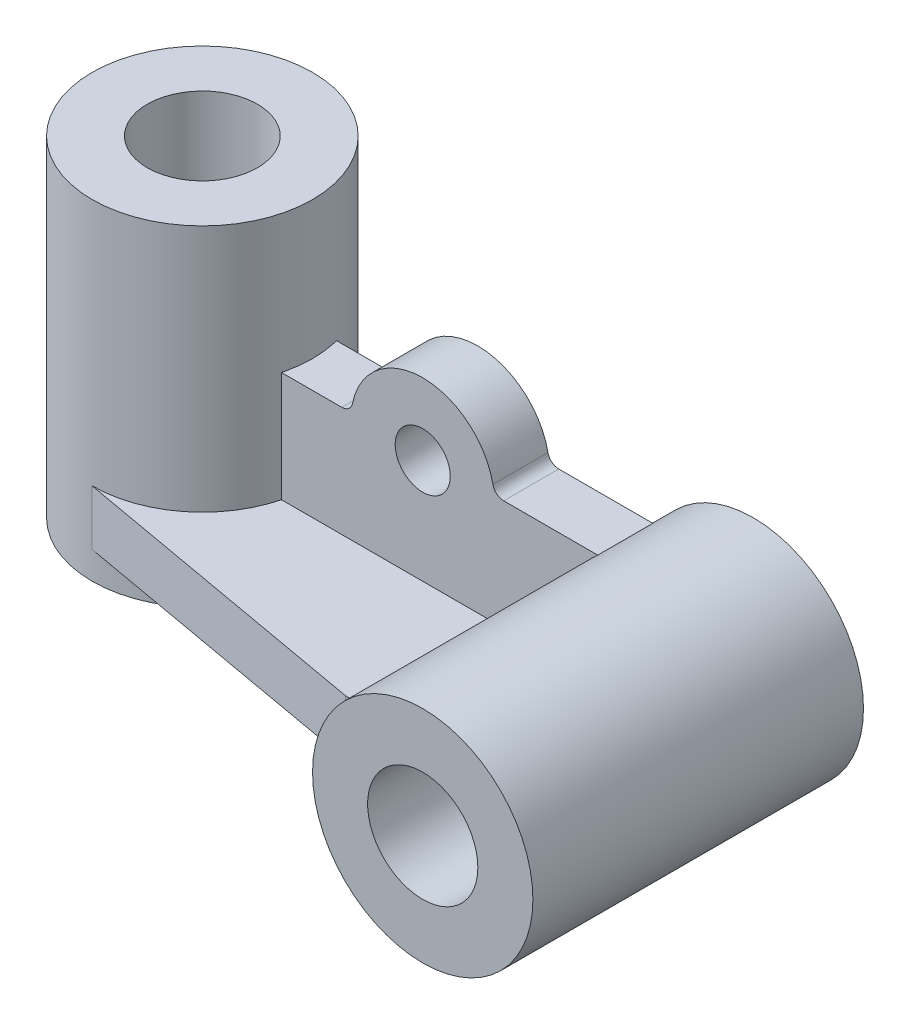
ISO-10303-21;
HEADER;
FILE_DESCRIPTION(('STEP AP214'),'2;1');
FILE_NAME('part.step','',(''),(''),'','','');
FILE_SCHEMA(('AUTOMOTIVE_DESIGN { 1 0 10303 214 1 1 1 1 }'));
ENDSEC;
DATA;
#1=APPLICATION_CONTEXT('core data for automotive mechanical design processes');
#2=APPLICATION_PROTOCOL_DEFINITION('international standard','automotive_design',2000,#1);
#3=PRODUCT_CONTEXT('',#1,'mechanical');
#4=PRODUCT('Part','Part','',(#3));
#5=PRODUCT_RELATED_PRODUCT_CATEGORY('part','',(#4));
#6=PRODUCT_DEFINITION_FORMATION('','',#4);
#7=PRODUCT_DEFINITION_CONTEXT('part definition',#1,'design');
#8=PRODUCT_DEFINITION('design','',#6,#7);
#9=PRODUCT_DEFINITION_SHAPE('','',#8);
#10=(LENGTH_UNIT() NAMED_UNIT(*) SI_UNIT(.MILLI.,.METRE.));
#11=(NAMED_UNIT(*) PLANE_ANGLE_UNIT() SI_UNIT($,.RADIAN.));
#12=(NAMED_UNIT(*) SI_UNIT($,.STERADIAN.) SOLID_ANGLE_UNIT());
#13=UNCERTAINTY_MEASURE_WITH_UNIT(LENGTH_MEASURE(1.E-05),#10,'distance_accuracy_value','');
#14=(GEOMETRIC_REPRESENTATION_CONTEXT(3) GLOBAL_UNCERTAINTY_ASSIGNED_CONTEXT((#13)) GLOBAL_UNIT_ASSIGNED_CONTEXT((#10,
#11,#12)) REPRESENTATION_CONTEXT('',''));
#15=CARTESIAN_POINT('',(0.,0.,0.));
#16=DIRECTION('',(0.,0.,1.));
#17=DIRECTION('',(1.,0.,0.));
#18=AXIS2_PLACEMENT_3D('',#15,#16,#17);
#19=CARTESIAN_POINT('',(77.3091008088365,-15.,30.));
#20=DIRECTION('',(-1.,0.,0.));
#21=DIRECTION('',(0.,0.,1.));
#22=AXIS2_PLACEMENT_3D('',#19,#20,#21);
#23=PLANE('',#22);
#24=DIRECTION('',(0.,0.,-1.));
#25=VECTOR('',#24,1.);
#26=CARTESIAN_POINT('',(77.3091008088365,-25.,30.));
#27=LINE('',#26,#25);
#28=CARTESIAN_POINT('',(77.3091008088365,-25.,30.));
#29=VERTEX_POINT('',#28);
#30=CARTESIAN_POINT('',(77.3091008088365,-25.,5.));
#31=VERTEX_POINT('',#30);
#32=EDGE_CURVE('E124',#29,#31,#27,.T.);
#33=ORIENTED_EDGE('',*,*,#32,.T.);
#34=DIRECTION('',(0.,-1.,0.));
#35=VECTOR('',#34,1.);
#36=CARTESIAN_POINT('',(77.3091008088365,-15.,5.));
#37=LINE('',#36,#35);
#38=CARTESIAN_POINT('',(77.3091008088365,-15.,5.));
#39=VERTEX_POINT('',#38);
#40=EDGE_CURVE('E12',#39,#31,#37,.T.);
#41=ORIENTED_EDGE('',*,*,#40,.F.);
#42=DIRECTION('',(0.,0.,-1.));
#43=VECTOR('',#42,1.);
#44=CARTESIAN_POINT('',(77.3091008088365,-15.,30.));
#45=LINE('',#44,#43);
#46=CARTESIAN_POINT('',(77.3091008088365,-15.,30.));
#47=VERTEX_POINT('',#46);
#48=EDGE_CURVE('E132',#47,#39,#45,.T.);
#49=ORIENTED_EDGE('',*,*,#48,.F.);
#50=DIRECTION('',(0.,-1.,0.));
#51=VECTOR('',#50,1.);
#52=CARTESIAN_POINT('',(77.3091008088365,-15.,30.));
#53=LINE('',#52,#51);
#54=EDGE_CURVE('E120',#47,#29,#53,.T.);
#55=ORIENTED_EDGE('',*,*,#54,.T.);
#56=EDGE_LOOP('',(#33,#41,#49,#55));
#57=FACE_BOUND('',#56,.T.);
#58=ADVANCED_FACE('F50',(#57),#23,.F.);
#59=CARTESIAN_POINT('',(19.3649167310371,-15.,5.));
#60=DIRECTION('',(0.,0.,1.));
#61=DIRECTION('',(1.,0.,0.));
#62=AXIS2_PLACEMENT_3D('',#59,#60,#61);
#63=PLANE('',#62);
#64=DIRECTION('',(-1.,0.,0.));
#65=VECTOR('',#64,1.);
#66=CARTESIAN_POINT('',(19.3649167310371,-25.,5.));
#67=LINE('',#66,#65);
#68=CARTESIAN_POINT('',(19.3649167310371,-25.,5.));
#69=VERTEX_POINT('',#68);
#70=EDGE_CURVE('E127',#31,#69,#67,.T.);
#71=ORIENTED_EDGE('',*,*,#70,.T.);
#72=DIRECTION('',(0.,-1.,0.));
#73=VECTOR('',#72,1.);
#74=CARTESIAN_POINT('',(19.3649167310371,-15.,5.));
#75=LINE('',#74,#73);
#76=CARTESIAN_POINT('',(19.3649167310371,-15.,5.));
#77=VERTEX_POINT('',#76);
#78=EDGE_CURVE('E58',#77,#69,#75,.T.);
#79=ORIENTED_EDGE('',*,*,#78,.F.);
#80=DIRECTION('',(-1.,0.,0.));
#81=VECTOR('',#80,1.);
#82=CARTESIAN_POINT('',(19.3649167310371,-15.,5.));
#83=LINE('',#82,#81);
#84=EDGE_CURVE('E100',#39,#77,#83,.T.);
#85=ORIENTED_EDGE('',*,*,#84,.F.);
#86=ORIENTED_EDGE('',*,*,#40,.T.);
#87=EDGE_LOOP('',(#71,#79,#85,#86));
#88=FACE_BOUND('',#87,.T.);
#89=ADVANCED_FACE('F151',(#88),#63,.F.);
#90=CARTESIAN_POINT('',(0.,-15.,0.));
#91=DIRECTION('',(0.,-1.,0.));
#92=DIRECTION('',(0.,0.,-1.));
#93=AXIS2_PLACEMENT_3D('',#90,#91,#92);
#94=CYLINDRICAL_SURFACE('',#93,20.);
#95=CARTESIAN_POINT('',(0.,-25.,0.));
#96=DIRECTION('',(0.,-1.,0.));
#97=DIRECTION('',(0.,0.,1.));
#98=AXIS2_PLACEMENT_3D('',#95,#96,#97);
#99=CIRCLE('',#98,20.);
#100=CARTESIAN_POINT('',(0.,-25.,20.));
#101=VERTEX_POINT('',#100);
#102=EDGE_CURVE('E115',#69,#101,#99,.T.);
#103=ORIENTED_EDGE('',*,*,#102,.T.);
#104=DIRECTION('',(0.,-1.,0.));
#105=VECTOR('',#104,1.);
#106=CARTESIAN_POINT('',(0.,-15.,20.));
#107=LINE('',#106,#105);
#108=CARTESIAN_POINT('',(0.,-15.,20.));
#109=VERTEX_POINT('',#108);
#110=EDGE_CURVE('E112',#109,#101,#107,.T.);
#111=ORIENTED_EDGE('',*,*,#110,.F.);
#112=CARTESIAN_POINT('',(0.,-15.,0.));
#113=DIRECTION('',(0.,-1.,0.));
#114=DIRECTION('',(0.,0.,1.));
#115=AXIS2_PLACEMENT_3D('',#112,#113,#114);
#116=CIRCLE('',#115,20.);
#117=EDGE_CURVE('E104',#77,#109,#116,.T.);
#118=ORIENTED_EDGE('',*,*,#117,.F.);
#119=ORIENTED_EDGE('',*,*,#78,.T.);
#120=EDGE_LOOP('',(#103,#111,#118,#119));
#121=FACE_BOUND('',#120,.T.);
#122=ADVANCED_FACE('F113',(#121),#94,.F.);
#123=CARTESIAN_POINT('',(0.,-15.,20.));
#124=DIRECTION('',(0.175790638483658,0.,-0.984427575508482));
#125=DIRECTION('',(-0.984427575508482,0.,-0.175790638483658));
#126=AXIS2_PLACEMENT_3D('',#123,#124,#125);
#127=PLANE('',#126);
#128=DIRECTION('',(0.984427575508482,0.,0.175790638483658));
#129=VECTOR('',#128,1.);
#130=CARTESIAN_POINT('',(0.,-25.,20.));
#131=LINE('',#130,#129);
#132=CARTESIAN_POINT('',(56.,-25.,30.));
#133=VERTEX_POINT('',#132);
#134=EDGE_CURVE('E86',#101,#133,#131,.T.);
#135=ORIENTED_EDGE('',*,*,#134,.T.);
#136=DIRECTION('',(0.,-1.,0.));
#137=VECTOR('',#136,1.);
#138=CARTESIAN_POINT('',(56.,-15.,30.));
#139=LINE('',#138,#137);
#140=CARTESIAN_POINT('',(56.,-15.,30.));
#141=VERTEX_POINT('',#140);
#142=EDGE_CURVE('E116',#141,#133,#139,.T.);
#143=ORIENTED_EDGE('',*,*,#142,.F.);
#144=DIRECTION('',(0.984427575508482,0.,0.175790638483658));
#145=VECTOR('',#144,1.);
#146=CARTESIAN_POINT('',(0.,-15.,20.));
#147=LINE('',#146,#145);
#148=EDGE_CURVE('E108',#109,#141,#147,.T.);
#149=ORIENTED_EDGE('',*,*,#148,.F.);
#150=ORIENTED_EDGE('',*,*,#110,.T.);
#151=EDGE_LOOP('',(#135,#143,#149,#150));
#152=FACE_BOUND('',#151,.T.);
#153=ADVANCED_FACE('F118',(#152),#127,.F.);
#154=CARTESIAN_POINT('',(56.,-15.,30.));
#155=DIRECTION('',(0.,0.,-1.));
#156=DIRECTION('',(-1.,0.,0.));
#157=AXIS2_PLACEMENT_3D('',#154,#155,#156);
#158=PLANE('',#157);
#159=DIRECTION('',(1.,0.,0.));
#160=VECTOR('',#159,1.);
#161=CARTESIAN_POINT('',(56.,-25.,30.));
#162=LINE('',#161,#160);
#163=EDGE_CURVE('E92',#133,#29,#162,.T.);
#164=ORIENTED_EDGE('',*,*,#163,.T.);
#165=ORIENTED_EDGE('',*,*,#54,.F.);
#166=DIRECTION('',(1.,0.,0.));
#167=VECTOR('',#166,1.);
#168=CARTESIAN_POINT('',(56.,-15.,30.));
#169=LINE('',#168,#167);
#170=EDGE_CURVE('E66',#141,#47,#169,.T.);
#171=ORIENTED_EDGE('',*,*,#170,.F.);
#172=ORIENTED_EDGE('',*,*,#142,.T.);
#173=EDGE_LOOP('',(#164,#165,#171,#172));
#174=FACE_BOUND('',#173,.T.);
#175=ADVANCED_FACE('F140',(#174),#158,.F.);
#176=CARTESIAN_POINT('',(0.,-15.,0.));
#177=DIRECTION('',(0.,1.,0.));
#178=DIRECTION('',(0.,0.,1.));
#179=AXIS2_PLACEMENT_3D('',#176,#177,#178);
#180=PLANE('',#179);
#181=ORIENTED_EDGE('',*,*,#48,.T.);
#182=ORIENTED_EDGE('',*,*,#84,.T.);
#183=ORIENTED_EDGE('',*,*,#117,.T.);
#184=ORIENTED_EDGE('',*,*,#148,.T.);
#185=ORIENTED_EDGE('',*,*,#170,.T.);
#186=EDGE_LOOP('',(#181,#182,#183,#184,#185));
#187=FACE_BOUND('',#186,.T.);
#188=ADVANCED_FACE('F106',(#187),#180,.T.);
#189=CARTESIAN_POINT('',(0.,-25.,0.));
#190=DIRECTION('',(0.,1.,0.));
#191=DIRECTION('',(0.,0.,1.));
#192=AXIS2_PLACEMENT_3D('',#189,#190,#191);
#193=PLANE('',#192);
#194=ORIENTED_EDGE('',*,*,#32,.F.);
#195=ORIENTED_EDGE('',*,*,#163,.F.);
#196=ORIENTED_EDGE('',*,*,#134,.F.);
#197=ORIENTED_EDGE('',*,*,#102,.F.);
#198=ORIENTED_EDGE('',*,*,#70,.F.);
#199=EDGE_LOOP('',(#194,#195,#196,#197,#198));
#200=FACE_BOUND('',#199,.T.);
#201=ADVANCED_FACE('F136',(#200),#193,.F.);
#202=CLOSED_SHELL('',(#58,#89,#122,#153,#175,#188,#201));
#203=MANIFOLD_SOLID_BREP('B2',#202);
#204=CARTESIAN_POINT('',(90.0000000000001,-10.,5.));
#205=DIRECTION('',(0.,0.,-1.));
#206=DIRECTION('',(-1.,0.,0.));
#207=AXIS2_PLACEMENT_3D('',#204,#205,#206);
#208=PLANE('',#207);
#209=DIRECTION('',(0.,-1.,0.));
#210=VECTOR('',#209,1.);
#211=CARTESIAN_POINT('',(10.,5.,5.));
#212=LINE('',#211,#210);
#213=CARTESIAN_POINT('',(10.,5.,5.));
#214=VERTEX_POINT('',#213);
#215=CARTESIAN_POINT('',(10.,-15.,5.));
#216=VERTEX_POINT('',#215);
#217=EDGE_CURVE('E322',#214,#216,#212,.T.);
#218=ORIENTED_EDGE('',*,*,#217,.T.);
#219=DIRECTION('',(1.,0.,0.));
#220=VECTOR('',#219,1.);
#221=CARTESIAN_POINT('',(10.,-15.,5.));
#222=LINE('',#221,#220);
#223=CARTESIAN_POINT('',(70.6350832689629,-15.,5.));
#224=VERTEX_POINT('',#223);
#225=EDGE_CURVE('E270',#216,#224,#222,.T.);
#226=ORIENTED_EDGE('',*,*,#225,.T.);
#227=CARTESIAN_POINT('',(90.0000000000001,-10.,5.));
#228=DIRECTION('',(0.,0.,-1.));
#229=DIRECTION('',(-1.,0.,0.));
#230=AXIS2_PLACEMENT_3D('',#227,#228,#229);
#231=CIRCLE('',#230,20.);
#232=CARTESIAN_POINT('',(76.7712434446771,5.,5.));
#233=VERTEX_POINT('',#232);
#234=EDGE_CURVE('E337',#224,#233,#231,.T.);
#235=ORIENTED_EDGE('',*,*,#234,.T.);
#236=DIRECTION('',(-1.,0.,0.));
#237=VECTOR('',#236,1.);
#238=CARTESIAN_POINT('',(59.6969384566991,5.,5.));
#239=LINE('',#238,#237);
#240=CARTESIAN_POINT('',(59.6969384566991,5.,5.));
#241=VERTEX_POINT('',#240);
#242=EDGE_CURVE('E350',#233,#241,#239,.T.);
#243=ORIENTED_EDGE('',*,*,#242,.T.);
#244=CARTESIAN_POINT('',(59.6969384566991,7.,5.));
#245=DIRECTION('',(0.,0.,-1.));
#246=DIRECTION('',(-1.,0.,0.));
#247=AXIS2_PLACEMENT_3D('',#244,#245,#246);
#248=CIRCLE('',#247,2.);
#249=CARTESIAN_POINT('',(57.7373466624725,6.6,5.));
#250=VERTEX_POINT('',#249);
#251=EDGE_CURVE('E289',#241,#250,#248,.T.);
#252=ORIENTED_EDGE('',*,*,#251,.T.);
#253=CARTESIAN_POINT('',(45.,4.,5.));
#254=DIRECTION('',(0.,0.,1.));
#255=DIRECTION('',(-1.,0.,0.));
#256=AXIS2_PLACEMENT_3D('',#253,#254,#255);
#257=CIRCLE('',#256,13.);
#258=CARTESIAN_POINT('',(32.2626533375275,6.6,5.));
#259=VERTEX_POINT('',#258);
#260=EDGE_CURVE('E283',#250,#259,#257,.T.);
#261=ORIENTED_EDGE('',*,*,#260,.T.);
#262=CARTESIAN_POINT('',(30.303061543301,7.,5.));
#263=DIRECTION('',(0.,0.,-1.));
#264=DIRECTION('',(1.,0.,0.));
#265=AXIS2_PLACEMENT_3D('',#262,#263,#264);
#266=CIRCLE('',#265,2.);
#267=CARTESIAN_POINT('',(30.303061543301,5.,5.));
#268=VERTEX_POINT('',#267);
#269=EDGE_CURVE('E287',#259,#268,#266,.T.);
#270=ORIENTED_EDGE('',*,*,#269,.T.);
#271=DIRECTION('',(-1.,0.,0.));
#272=VECTOR('',#271,1.);
#273=CARTESIAN_POINT('',(10.,5.,5.));
#274=LINE('',#273,#272);
#275=EDGE_CURVE('E227',#268,#214,#274,.T.);
#276=ORIENTED_EDGE('',*,*,#275,.T.);
#277=EDGE_LOOP('',(#218,#226,#235,#243,#252,#261,#270,#276));
#278=FACE_BOUND('',#277,.T.);
#279=CARTESIAN_POINT('',(45.,4.,5.));
#280=DIRECTION('',(0.,0.,1.));
#281=DIRECTION('',(1.,0.,0.));
#282=AXIS2_PLACEMENT_3D('',#279,#280,#281);
#283=CIRCLE('',#282,5.);
#284=CARTESIAN_POINT('',(50.,4.,5.));
#285=VERTEX_POINT('',#284);
#286=EDGE_CURVE('E311',#285,#285,#283,.T.);
#287=ORIENTED_EDGE('',*,*,#286,.F.);
#288=EDGE_LOOP('',(#287));
#289=FACE_BOUND('',#288,.T.);
#290=ADVANCED_FACE('F210',(#278,#289),#208,.F.);
#291=CARTESIAN_POINT('',(90.0000000000001,-10.,-5.));
#292=DIRECTION('',(0.,0.,-1.));
#293=DIRECTION('',(-1.,0.,0.));
#294=AXIS2_PLACEMENT_3D('',#291,#292,#293);
#295=PLANE('',#294);
#296=DIRECTION('',(0.,-1.,0.));
#297=VECTOR('',#296,1.);
#298=CARTESIAN_POINT('',(10.,5.,-5.));
#299=LINE('',#298,#297);
#300=CARTESIAN_POINT('',(10.,5.,-5.));
#301=VERTEX_POINT('',#300);
#302=CARTESIAN_POINT('',(10.,-15.,-5.));
#303=VERTEX_POINT('',#302);
#304=EDGE_CURVE('E307',#301,#303,#299,.T.);
#305=ORIENTED_EDGE('',*,*,#304,.F.);
#306=DIRECTION('',(-1.,0.,0.));
#307=VECTOR('',#306,1.);
#308=CARTESIAN_POINT('',(10.,5.,-5.));
#309=LINE('',#308,#307);
#310=CARTESIAN_POINT('',(30.303061543301,5.,-5.));
#311=VERTEX_POINT('',#310);
#312=EDGE_CURVE('E262',#311,#301,#309,.T.);
#313=ORIENTED_EDGE('',*,*,#312,.F.);
#314=CARTESIAN_POINT('',(30.303061543301,7.,-5.));
#315=DIRECTION('',(0.,0.,-1.));
#316=DIRECTION('',(1.,0.,0.));
#317=AXIS2_PLACEMENT_3D('',#314,#315,#316);
#318=CIRCLE('',#317,2.);
#319=CARTESIAN_POINT('',(32.2626533375275,6.6,-5.));
#320=VERTEX_POINT('',#319);
#321=EDGE_CURVE('E256',#320,#311,#318,.T.);
#322=ORIENTED_EDGE('',*,*,#321,.F.);
#323=CARTESIAN_POINT('',(45.,4.,-5.));
#324=DIRECTION('',(0.,0.,1.));
#325=DIRECTION('',(-1.,0.,0.));
#326=AXIS2_PLACEMENT_3D('',#323,#324,#325);
#327=CIRCLE('',#326,13.);
#328=CARTESIAN_POINT('',(57.7373466624725,6.6,-5.));
#329=VERTEX_POINT('',#328);
#330=EDGE_CURVE('E297',#329,#320,#327,.T.);
#331=ORIENTED_EDGE('',*,*,#330,.F.);
#332=CARTESIAN_POINT('',(59.6969384566991,7.,-5.));
#333=DIRECTION('',(0.,0.,-1.));
#334=DIRECTION('',(-1.,0.,0.));
#335=AXIS2_PLACEMENT_3D('',#332,#333,#334);
#336=CIRCLE('',#335,2.);
#337=CARTESIAN_POINT('',(59.6969384566991,5.,-5.));
#338=VERTEX_POINT('',#337);
#339=EDGE_CURVE('E317',#338,#329,#336,.T.);
#340=ORIENTED_EDGE('',*,*,#339,.F.);
#341=DIRECTION('',(-1.,0.,0.));
#342=VECTOR('',#341,1.);
#343=CARTESIAN_POINT('',(59.6969384566991,5.,-5.));
#344=LINE('',#343,#342);
#345=CARTESIAN_POINT('',(76.7712434446771,5.,-5.));
#346=VERTEX_POINT('',#345);
#347=EDGE_CURVE('E315',#346,#338,#344,.T.);
#348=ORIENTED_EDGE('',*,*,#347,.F.);
#349=CARTESIAN_POINT('',(90.0000000000001,-10.,-5.));
#350=DIRECTION('',(0.,0.,-1.));
#351=DIRECTION('',(-1.,0.,0.));
#352=AXIS2_PLACEMENT_3D('',#349,#350,#351);
#353=CIRCLE('',#352,20.);
#354=CARTESIAN_POINT('',(70.6350832689629,-15.,-5.));
#355=VERTEX_POINT('',#354);
#356=EDGE_CURVE('E313',#355,#346,#353,.T.);
#357=ORIENTED_EDGE('',*,*,#356,.F.);
#358=DIRECTION('',(1.,0.,0.));
#359=VECTOR('',#358,1.);
#360=CARTESIAN_POINT('',(10.,-15.,-5.));
#361=LINE('',#360,#359);
#362=EDGE_CURVE('E310',#303,#355,#361,.T.);
#363=ORIENTED_EDGE('',*,*,#362,.F.);
#364=EDGE_LOOP('',(#305,#313,#322,#331,#340,#348,#357,#363));
#365=FACE_BOUND('',#364,.T.);
#366=CARTESIAN_POINT('',(45.,4.,-5.));
#367=DIRECTION('',(0.,0.,1.));
#368=DIRECTION('',(1.,0.,0.));
#369=AXIS2_PLACEMENT_3D('',#366,#367,#368);
#370=CIRCLE('',#369,5.);
#371=CARTESIAN_POINT('',(50.,4.,-5.));
#372=VERTEX_POINT('',#371);
#373=EDGE_CURVE('E356',#372,#372,#370,.T.);
#374=ORIENTED_EDGE('',*,*,#373,.T.);
#375=EDGE_LOOP('',(#374));
#376=FACE_BOUND('',#375,.T.);
#377=ADVANCED_FACE('F341',(#365,#376),#295,.T.);
#378=CARTESIAN_POINT('',(10.,5.,5.));
#379=DIRECTION('',(1.,0.,0.));
#380=DIRECTION('',(0.,1.,0.));
#381=AXIS2_PLACEMENT_3D('',#378,#379,#380);
#382=PLANE('',#381);
#383=ORIENTED_EDGE('',*,*,#304,.T.);
#384=DIRECTION('',(0.,0.,-1.));
#385=VECTOR('',#384,1.);
#386=CARTESIAN_POINT('',(10.,-15.,5.));
#387=LINE('',#386,#385);
#388=EDGE_CURVE('E48',#216,#303,#387,.T.);
#389=ORIENTED_EDGE('',*,*,#388,.F.);
#390=ORIENTED_EDGE('',*,*,#217,.F.);
#391=DIRECTION('',(0.,0.,-1.));
#392=VECTOR('',#391,1.);
#393=CARTESIAN_POINT('',(10.,5.,5.));
#394=LINE('',#393,#392);
#395=EDGE_CURVE('E303',#214,#301,#394,.T.);
#396=ORIENTED_EDGE('',*,*,#395,.T.);
#397=EDGE_LOOP('',(#383,#389,#390,#396));
#398=FACE_BOUND('',#397,.T.);
#399=ADVANCED_FACE('F212',(#398),#382,.F.);
#400=CARTESIAN_POINT('',(10.,-15.,5.));
#401=DIRECTION('',(0.,1.,0.));
#402=DIRECTION('',(0.,0.,1.));
#403=AXIS2_PLACEMENT_3D('',#400,#401,#402);
#404=PLANE('',#403);
#405=ORIENTED_EDGE('',*,*,#362,.T.);
#406=DIRECTION('',(0.,0.,-1.));
#407=VECTOR('',#406,1.);
#408=CARTESIAN_POINT('',(70.6350832689629,-15.,5.));
#409=LINE('',#408,#407);
#410=EDGE_CURVE('E219',#224,#355,#409,.T.);
#411=ORIENTED_EDGE('',*,*,#410,.F.);
#412=ORIENTED_EDGE('',*,*,#225,.F.);
#413=ORIENTED_EDGE('',*,*,#388,.T.);
#414=EDGE_LOOP('',(#405,#411,#412,#413));
#415=FACE_BOUND('',#414,.T.);
#416=ADVANCED_FACE('F384',(#415),#404,.F.);
#417=CARTESIAN_POINT('',(90.0000000000001,-10.,5.));
#418=DIRECTION('',(0.,0.,-1.));
#419=DIRECTION('',(-1.,0.,0.));
#420=AXIS2_PLACEMENT_3D('',#417,#418,#419);
#421=CYLINDRICAL_SURFACE('',#420,20.);
#422=ORIENTED_EDGE('',*,*,#356,.T.);
#423=DIRECTION('',(0.,0.,-1.));
#424=VECTOR('',#423,1.);
#425=CARTESIAN_POINT('',(76.7712434446771,5.,5.));
#426=LINE('',#425,#424);
#427=EDGE_CURVE('E329',#233,#346,#426,.T.);
#428=ORIENTED_EDGE('',*,*,#427,.F.);
#429=ORIENTED_EDGE('',*,*,#234,.F.);
#430=ORIENTED_EDGE('',*,*,#410,.T.);
#431=EDGE_LOOP('',(#422,#428,#429,#430));
#432=FACE_BOUND('',#431,.T.);
#433=ADVANCED_FACE('F335',(#432),#421,.F.);
#434=CARTESIAN_POINT('',(59.6969384566991,5.,5.));
#435=DIRECTION('',(0.,-1.,0.));
#436=DIRECTION('',(0.,0.,-1.));
#437=AXIS2_PLACEMENT_3D('',#434,#435,#436);
#438=PLANE('',#437);
#439=ORIENTED_EDGE('',*,*,#347,.T.);
#440=DIRECTION('',(0.,0.,-1.));
#441=VECTOR('',#440,1.);
#442=CARTESIAN_POINT('',(59.6969384566991,5.,5.));
#443=LINE('',#442,#441);
#444=EDGE_CURVE('E326',#241,#338,#443,.T.);
#445=ORIENTED_EDGE('',*,*,#444,.F.);
#446=ORIENTED_EDGE('',*,*,#242,.F.);
#447=ORIENTED_EDGE('',*,*,#427,.T.);
#448=EDGE_LOOP('',(#439,#445,#446,#447));
#449=FACE_BOUND('',#448,.T.);
#450=ADVANCED_FACE('F346',(#449),#438,.F.);
#451=CARTESIAN_POINT('',(59.6969384566991,7.,5.));
#452=DIRECTION('',(0.,0.,-1.));
#453=DIRECTION('',(-1.,0.,0.));
#454=AXIS2_PLACEMENT_3D('',#451,#452,#453);
#455=CYLINDRICAL_SURFACE('',#454,2.);
#456=ORIENTED_EDGE('',*,*,#339,.T.);
#457=DIRECTION('',(0.,0.,-1.));
#458=VECTOR('',#457,1.);
#459=CARTESIAN_POINT('',(57.7373466624725,6.6,5.));
#460=LINE('',#459,#458);
#461=EDGE_CURVE('E298',#250,#329,#460,.T.);
#462=ORIENTED_EDGE('',*,*,#461,.F.);
#463=ORIENTED_EDGE('',*,*,#251,.F.);
#464=ORIENTED_EDGE('',*,*,#444,.T.);
#465=EDGE_LOOP('',(#456,#462,#463,#464));
#466=FACE_BOUND('',#465,.T.);
#467=ADVANCED_FACE('F349',(#466),#455,.F.);
#468=CARTESIAN_POINT('',(45.,4.,5.));
#469=DIRECTION('',(0.,0.,-1.));
#470=DIRECTION('',(-1.,0.,0.));
#471=AXIS2_PLACEMENT_3D('',#468,#469,#470);
#472=CYLINDRICAL_SURFACE('',#471,13.);
#473=ORIENTED_EDGE('',*,*,#330,.T.);
#474=DIRECTION('',(0.,0.,-1.));
#475=VECTOR('',#474,1.);
#476=CARTESIAN_POINT('',(32.2626533375275,6.6,5.));
#477=LINE('',#476,#475);
#478=EDGE_CURVE('E294',#259,#320,#477,.T.);
#479=ORIENTED_EDGE('',*,*,#478,.F.);
#480=ORIENTED_EDGE('',*,*,#260,.F.);
#481=ORIENTED_EDGE('',*,*,#461,.T.);
#482=EDGE_LOOP('',(#473,#479,#480,#481));
#483=FACE_BOUND('',#482,.T.);
#484=ADVANCED_FACE('F295',(#483),#472,.T.);
#485=CARTESIAN_POINT('',(30.303061543301,7.,5.));
#486=DIRECTION('',(0.,0.,-1.));
#487=DIRECTION('',(-1.,0.,0.));
#488=AXIS2_PLACEMENT_3D('',#485,#486,#487);
#489=CYLINDRICAL_SURFACE('',#488,2.);
#490=ORIENTED_EDGE('',*,*,#321,.T.);
#491=DIRECTION('',(0.,0.,-1.));
#492=VECTOR('',#491,1.);
#493=CARTESIAN_POINT('',(30.303061543301,5.,5.));
#494=LINE('',#493,#492);
#495=EDGE_CURVE('E299',#268,#311,#494,.T.);
#496=ORIENTED_EDGE('',*,*,#495,.F.);
#497=ORIENTED_EDGE('',*,*,#269,.F.);
#498=ORIENTED_EDGE('',*,*,#478,.T.);
#499=EDGE_LOOP('',(#490,#496,#497,#498));
#500=FACE_BOUND('',#499,.T.);
#501=ADVANCED_FACE('F301',(#500),#489,.F.);
#502=CARTESIAN_POINT('',(10.,5.,5.));
#503=DIRECTION('',(0.,-1.,0.));
#504=DIRECTION('',(0.,0.,-1.));
#505=AXIS2_PLACEMENT_3D('',#502,#503,#504);
#506=PLANE('',#505);
#507=ORIENTED_EDGE('',*,*,#312,.T.);
#508=ORIENTED_EDGE('',*,*,#395,.F.);
#509=ORIENTED_EDGE('',*,*,#275,.F.);
#510=ORIENTED_EDGE('',*,*,#495,.T.);
#511=EDGE_LOOP('',(#507,#508,#509,#510));
#512=FACE_BOUND('',#511,.T.);
#513=ADVANCED_FACE('F372',(#512),#506,.F.);
#514=CARTESIAN_POINT('',(45.,4.,5.));
#515=DIRECTION('',(0.,0.,-1.));
#516=DIRECTION('',(-1.,0.,0.));
#517=AXIS2_PLACEMENT_3D('',#514,#515,#516);
#518=CYLINDRICAL_SURFACE('',#517,5.);
#519=ORIENTED_EDGE('',*,*,#286,.T.);
#520=EDGE_LOOP('',(#519));
#521=FACE_BOUND('',#520,.T.);
#522=ORIENTED_EDGE('',*,*,#373,.F.);
#523=EDGE_LOOP('',(#522));
#524=FACE_BOUND('',#523,.T.);
#525=ADVANCED_FACE('F362',(#521,#524),#518,.F.);
#526=CLOSED_SHELL('',(#290,#377,#399,#416,#433,#450,#467,#484,#501,#513,#525));
#527=MANIFOLD_SOLID_BREP('B6',#526);
#528=CARTESIAN_POINT('',(90.,-10.,-9.99999999999999));
#529=DIRECTION('',(0.,0.,1.));
#530=DIRECTION('',(1.,0.,0.));
#531=AXIS2_PLACEMENT_3D('',#528,#529,#530);
#532=CYLINDRICAL_SURFACE('',#531,20.);
#533=CARTESIAN_POINT('',(90.,-10.,-9.99999999999999));
#534=DIRECTION('',(0.,0.,1.));
#535=DIRECTION('',(1.,0.,0.));
#536=AXIS2_PLACEMENT_3D('',#533,#534,#535);
#537=CIRCLE('',#536,20.);
#538=CARTESIAN_POINT('',(110.,-10.,-9.99999999999999));
#539=VERTEX_POINT('',#538);
#540=EDGE_CURVE('E209',#539,#539,#537,.T.);
#541=ORIENTED_EDGE('',*,*,#540,.T.);
#542=EDGE_LOOP('',(#541));
#543=FACE_BOUND('',#542,.T.);
#544=CARTESIAN_POINT('',(90.,-10.,50.));
#545=DIRECTION('',(0.,0.,1.));
#546=DIRECTION('',(1.,0.,0.));
#547=AXIS2_PLACEMENT_3D('',#544,#545,#546);
#548=CIRCLE('',#547,20.);
#549=CARTESIAN_POINT('',(110.,-10.,50.));
#550=VERTEX_POINT('',#549);
#551=EDGE_CURVE('E471',#550,#550,#548,.T.);
#552=ORIENTED_EDGE('',*,*,#551,.F.);
#553=EDGE_LOOP('',(#552));
#554=FACE_BOUND('',#553,.T.);
#555=ADVANCED_FACE('F468',(#543,#554),#532,.T.);
#556=CARTESIAN_POINT('',(90.,-10.,-9.99999999999999));
#557=DIRECTION('',(0.,0.,1.));
#558=DIRECTION('',(1.,0.,0.));
#559=AXIS2_PLACEMENT_3D('',#556,#557,#558);
#560=PLANE('',#559);
#561=CARTESIAN_POINT('',(90.,-10.,-9.99999999999999));
#562=DIRECTION('',(0.,0.,1.));
#563=DIRECTION('',(1.,0.,0.));
#564=AXIS2_PLACEMENT_3D('',#561,#562,#563);
#565=CIRCLE('',#564,9.99999999999999);
#566=CARTESIAN_POINT('',(100.,-10.,-9.99999999999999));
#567=VERTEX_POINT('',#566);
#568=EDGE_CURVE('E478',#567,#567,#565,.T.);
#569=ORIENTED_EDGE('',*,*,#568,.T.);
#570=EDGE_LOOP('',(#569));
#571=FACE_BOUND('',#570,.T.);
#572=ORIENTED_EDGE('',*,*,#540,.F.);
#573=EDGE_LOOP('',(#572));
#574=FACE_BOUND('',#573,.T.);
#575=ADVANCED_FACE('F486',(#571,#574),#560,.F.);
#576=CARTESIAN_POINT('',(90.,-10.,50.));
#577=DIRECTION('',(0.,0.,1.));
#578=DIRECTION('',(1.,0.,0.));
#579=AXIS2_PLACEMENT_3D('',#576,#577,#578);
#580=PLANE('',#579);
#581=CARTESIAN_POINT('',(90.,-10.,50.));
#582=DIRECTION('',(0.,0.,1.));
#583=DIRECTION('',(1.,0.,0.));
#584=AXIS2_PLACEMENT_3D('',#581,#582,#583);
#585=CIRCLE('',#584,9.99999999999999);
#586=CARTESIAN_POINT('',(100.,-10.,50.));
#587=VERTEX_POINT('',#586);
#588=EDGE_CURVE('E480',#587,#587,#585,.T.);
#589=ORIENTED_EDGE('',*,*,#588,.F.);
#590=EDGE_LOOP('',(#589));
#591=FACE_BOUND('',#590,.T.);
#592=ORIENTED_EDGE('',*,*,#551,.T.);
#593=EDGE_LOOP('',(#592));
#594=FACE_BOUND('',#593,.T.);
#595=ADVANCED_FACE('F492',(#591,#594),#580,.T.);
#596=CARTESIAN_POINT('',(90.,-10.,-9.99999999999999));
#597=DIRECTION('',(0.,0.,1.));
#598=DIRECTION('',(1.,0.,0.));
#599=AXIS2_PLACEMENT_3D('',#596,#597,#598);
#600=CYLINDRICAL_SURFACE('',#599,9.99999999999999);
#601=ORIENTED_EDGE('',*,*,#568,.F.);
#602=EDGE_LOOP('',(#601));
#603=FACE_BOUND('',#602,.T.);
#604=ORIENTED_EDGE('',*,*,#588,.T.);
#605=EDGE_LOOP('',(#604));
#606=FACE_BOUND('',#605,.T.);
#607=ADVANCED_FACE('F489',(#603,#606),#600,.F.);
#608=CLOSED_SHELL('',(#555,#575,#595,#607));
#609=MANIFOLD_SOLID_BREP('B42',#608);
#610=CARTESIAN_POINT('',(20.,30.,0.));
#611=DIRECTION('',(0.,-1.,0.));
#612=DIRECTION('',(0.,0.,-1.));
#613=AXIS2_PLACEMENT_3D('',#610,#611,#612);
#614=PLANE('',#613);
#615=CARTESIAN_POINT('',(0.,30.,0.));
#616=DIRECTION('',(0.,1.,0.));
#617=DIRECTION('',(0.,0.,1.));
#618=AXIS2_PLACEMENT_3D('',#615,#616,#617);
#619=CIRCLE('',#618,10.);
#620=CARTESIAN_POINT('',(0.,30.,10.));
#621=VERTEX_POINT('',#620);
#622=EDGE_CURVE('E546',#621,#621,#619,.T.);
#623=ORIENTED_EDGE('',*,*,#622,.F.);
#624=EDGE_LOOP('',(#623));
#625=FACE_BOUND('',#624,.T.);
#626=CARTESIAN_POINT('',(0.,30.,0.));
#627=DIRECTION('',(0.,1.,0.));
#628=DIRECTION('',(0.,0.,1.));
#629=AXIS2_PLACEMENT_3D('',#626,#627,#628);
#630=CIRCLE('',#629,20.);
#631=CARTESIAN_POINT('',(0.,30.,20.));
#632=VERTEX_POINT('',#631);
#633=EDGE_CURVE('E538',#632,#632,#630,.T.);
#634=ORIENTED_EDGE('',*,*,#633,.T.);
#635=EDGE_LOOP('',(#634));
#636=FACE_BOUND('',#635,.T.);
#637=ADVANCED_FACE('F532',(#625,#636),#614,.F.);
#638=CARTESIAN_POINT('',(0.,-30.,0.));
#639=DIRECTION('',(0.,1.,0.));
#640=DIRECTION('',(0.,0.,1.));
#641=AXIS2_PLACEMENT_3D('',#638,#639,#640);
#642=PLANE('',#641);
#643=CARTESIAN_POINT('',(0.,-30.,0.));
#644=DIRECTION('',(0.,1.,0.));
#645=DIRECTION('',(0.,0.,1.));
#646=AXIS2_PLACEMENT_3D('',#643,#644,#645);
#647=CIRCLE('',#646,10.);
#648=CARTESIAN_POINT('',(0.,-30.,10.));
#649=VERTEX_POINT('',#648);
#650=EDGE_CURVE('E542',#649,#649,#647,.T.);
#651=ORIENTED_EDGE('',*,*,#650,.T.);
#652=EDGE_LOOP('',(#651));
#653=FACE_BOUND('',#652,.T.);
#654=CARTESIAN_POINT('',(0.,-30.,0.));
#655=DIRECTION('',(0.,1.,0.));
#656=DIRECTION('',(0.,0.,1.));
#657=AXIS2_PLACEMENT_3D('',#654,#655,#656);
#658=CIRCLE('',#657,20.);
#659=CARTESIAN_POINT('',(0.,-30.,20.));
#660=VERTEX_POINT('',#659);
#661=EDGE_CURVE('E467',#660,#660,#658,.T.);
#662=ORIENTED_EDGE('',*,*,#661,.F.);
#663=EDGE_LOOP('',(#662));
#664=FACE_BOUND('',#663,.T.);
#665=ADVANCED_FACE('F555',(#653,#664),#642,.F.);
#666=CARTESIAN_POINT('',(0.,30.,0.));
#667=DIRECTION('',(0.,1.,0.));
#668=DIRECTION('',(0.,0.,1.));
#669=AXIS2_PLACEMENT_3D('',#666,#667,#668);
#670=CYLINDRICAL_SURFACE('',#669,20.);
#671=ORIENTED_EDGE('',*,*,#633,.F.);
#672=EDGE_LOOP('',(#671));
#673=FACE_BOUND('',#672,.T.);
#674=ORIENTED_EDGE('',*,*,#661,.T.);
#675=EDGE_LOOP('',(#674));
#676=FACE_BOUND('',#675,.T.);
#677=ADVANCED_FACE('F559',(#673,#676),#670,.T.);
#678=CARTESIAN_POINT('',(0.,-30.,0.));
#679=DIRECTION('',(0.,1.,0.));
#680=DIRECTION('',(0.,0.,1.));
#681=AXIS2_PLACEMENT_3D('',#678,#679,#680);
#682=CYLINDRICAL_SURFACE('',#681,10.);
#683=ORIENTED_EDGE('',*,*,#650,.F.);
#684=EDGE_LOOP('',(#683));
#685=FACE_BOUND('',#684,.T.);
#686=ORIENTED_EDGE('',*,*,#622,.T.);
#687=EDGE_LOOP('',(#686));
#688=FACE_BOUND('',#687,.T.);
#689=ADVANCED_FACE('F552',(#685,#688),#682,.F.);
#690=CLOSED_SHELL('',(#637,#665,#677,#689));
#691=MANIFOLD_SOLID_BREP('B204',#690);
#692=ADVANCED_BREP_SHAPE_REPRESENTATION('',(#18,#203,#527,#609,#691),#14);
#693=SHAPE_DEFINITION_REPRESENTATION(#9,#692);
ENDSEC;
END-ISO-10303-21;
